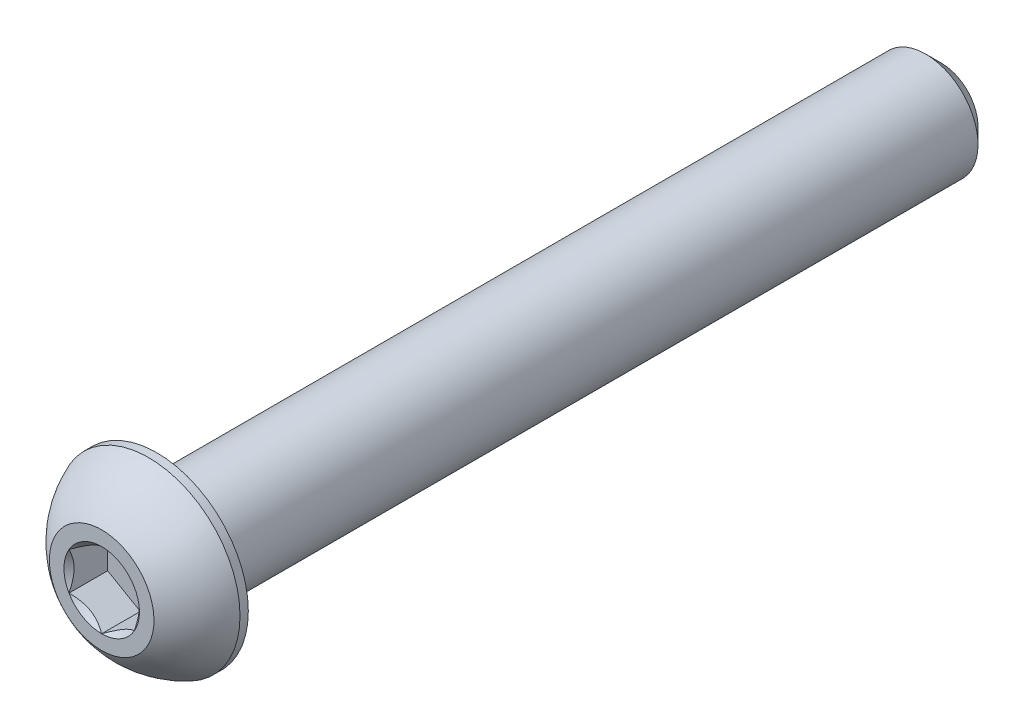
ISO-10303-21;
HEADER;
FILE_DESCRIPTION(('STEP AP214'),'2;1');
FILE_NAME('part.step','',(''),(''),'','','');
FILE_SCHEMA(('AUTOMOTIVE_DESIGN { 1 0 10303 214 1 1 1 1 }'));
ENDSEC;
DATA;
#1=APPLICATION_CONTEXT('core data for automotive mechanical design processes');
#2=APPLICATION_PROTOCOL_DEFINITION('international standard','automotive_design',2000,#1);
#3=PRODUCT_CONTEXT('',#1,'mechanical');
#4=PRODUCT('Part','Part','',(#3));
#5=PRODUCT_RELATED_PRODUCT_CATEGORY('part','',(#4));
#6=PRODUCT_DEFINITION_FORMATION('','',#4);
#7=PRODUCT_DEFINITION_CONTEXT('part definition',#1,'design');
#8=PRODUCT_DEFINITION('design','',#6,#7);
#9=PRODUCT_DEFINITION_SHAPE('','',#8);
#10=(LENGTH_UNIT() NAMED_UNIT(*) SI_UNIT(.MILLI.,.METRE.));
#11=(NAMED_UNIT(*) PLANE_ANGLE_UNIT() SI_UNIT($,.RADIAN.));
#12=(NAMED_UNIT(*) SI_UNIT($,.STERADIAN.) SOLID_ANGLE_UNIT());
#13=UNCERTAINTY_MEASURE_WITH_UNIT(LENGTH_MEASURE(1.E-05),#10,'distance_accuracy_value','');
#14=(GEOMETRIC_REPRESENTATION_CONTEXT(3) GLOBAL_UNCERTAINTY_ASSIGNED_CONTEXT((#13)) GLOBAL_UNIT_ASSIGNED_CONTEXT((#10,
#11,#12)) REPRESENTATION_CONTEXT('',''));
#15=CARTESIAN_POINT('',(0.,0.,0.));
#16=DIRECTION('',(0.,0.,1.));
#17=DIRECTION('',(1.,0.,0.));
#18=AXIS2_PLACEMENT_3D('',#15,#16,#17);
#19=CARTESIAN_POINT('',(0.,-3.175,-50.9778));
#20=DIRECTION('',(0.,0.,-1.));
#21=DIRECTION('',(0.,1.,0.));
#22=AXIS2_PLACEMENT_3D('',#19,#20,#21);
#23=PLANE('',#22);
#24=CARTESIAN_POINT('',(0.,0.,-50.9778));
#25=DIRECTION('',(0.,0.,-1.));
#26=DIRECTION('',(0.,1.,0.));
#27=AXIS2_PLACEMENT_3D('',#24,#25,#26);
#28=CIRCLE('',#27,2.2225);
#29=CARTESIAN_POINT('',(0.,2.2225,-50.9778));
#30=VERTEX_POINT('',#29);
#31=EDGE_CURVE('E173',#30,#30,#28,.T.);
#32=ORIENTED_EDGE('',*,*,#31,.T.);
#33=EDGE_LOOP('',(#32));
#34=FACE_BOUND('',#33,.T.);
#35=ADVANCED_FACE('F34',(#34),#23,.T.);
#36=CARTESIAN_POINT('',(0.,0.,-50.9778));
#37=DIRECTION('',(0.,0.,-1.));
#38=DIRECTION('',(0.,1.,0.));
#39=AXIS2_PLACEMENT_3D('',#36,#37,#38);
#40=CYLINDRICAL_SURFACE('',#39,3.175);
#41=CARTESIAN_POINT('',(0.,0.,-50.0253));
#42=DIRECTION('',(0.,0.,-1.));
#43=DIRECTION('',(0.,1.,0.));
#44=AXIS2_PLACEMENT_3D('',#41,#42,#43);
#45=CIRCLE('',#44,3.175);
#46=CARTESIAN_POINT('',(0.,3.175,-50.0253));
#47=VERTEX_POINT('',#46);
#48=EDGE_CURVE('E47',#47,#47,#45,.F.);
#49=ORIENTED_EDGE('',*,*,#48,.T.);
#50=EDGE_LOOP('',(#49));
#51=FACE_BOUND('',#50,.T.);
#52=CARTESIAN_POINT('',(0.,0.,-3.3528));
#53=DIRECTION('',(0.,0.,1.));
#54=DIRECTION('',(1.,0.,0.));
#55=AXIS2_PLACEMENT_3D('',#52,#53,#54);
#56=CIRCLE('',#55,3.175);
#57=CARTESIAN_POINT('',(3.175,0.,-3.3528));
#58=VERTEX_POINT('',#57);
#59=EDGE_CURVE('E170',#58,#58,#56,.F.);
#60=ORIENTED_EDGE('',*,*,#59,.T.);
#61=EDGE_LOOP('',(#60));
#62=FACE_BOUND('',#61,.T.);
#63=ADVANCED_FACE('F178',(#51,#62),#40,.T.);
#64=CARTESIAN_POINT('',(0.,0.,-50.9778));
#65=DIRECTION('',(0.,0.,1.));
#66=DIRECTION('',(0.,-1.,0.));
#67=AXIS2_PLACEMENT_3D('',#64,#65,#66);
#68=CONICAL_SURFACE('',#67,2.2225,0.785398163397447);
#69=ORIENTED_EDGE('',*,*,#48,.F.);
#70=EDGE_LOOP('',(#69));
#71=FACE_BOUND('',#70,.T.);
#72=ORIENTED_EDGE('',*,*,#31,.F.);
#73=EDGE_LOOP('',(#72));
#74=FACE_BOUND('',#73,.T.);
#75=ADVANCED_FACE('F36',(#71,#74),#68,.T.);
#76=CARTESIAN_POINT('',(0.,0.,-5.060315));
#77=DIRECTION('',(0.,0.,1.));
#78=DIRECTION('',(0.,-1.,0.));
#79=AXIS2_PLACEMENT_3D('',#76,#77,#78);
#80=SPHERICAL_SURFACE('',#79,5.97389428256184);
#81=CARTESIAN_POINT('',(0.,0.,0.));
#82=DIRECTION('',(0.,0.,1.));
#83=DIRECTION('',(1.,0.,0.));
#84=AXIS2_PLACEMENT_3D('',#81,#82,#83);
#85=CIRCLE('',#84,3.175);
#86=CARTESIAN_POINT('',(0.,-3.175,0.));
#87=VERTEX_POINT('',#86);
#88=EDGE_CURVE('E167',#87,#87,#85,.T.);
#89=CARTESIAN_POINT('',(0.,0.,-2.84988));
#90=DIRECTION('',(0.,0.,1.));
#91=DIRECTION('',(1.,0.,0.));
#92=AXIS2_PLACEMENT_3D('',#89,#90,#91);
#93=CIRCLE('',#92,5.5499);
#94=CARTESIAN_POINT('',(0.,-5.5499,-2.84988));
#95=VERTEX_POINT('',#94);
#96=EDGE_CURVE('E161',#95,#95,#93,.T.);
#97=CARTESIAN_POINT('',(0.,-3.175,0.));
#98=CARTESIAN_POINT('',(0.,-3.20828343957184,-0.0208830076580488));
#99=CARTESIAN_POINT('',(0.,-3.24136078860705,-0.0420944789280492));
#100=CARTESIAN_POINT('',(0.,-3.3070905577514,-0.0851658910984713));
#101=CARTESIAN_POINT('',(0.,-3.33974297786056,-0.107025831998893));
#102=CARTESIAN_POINT('',(0.,-3.40461014130008,-0.151385725836676));
#103=CARTESIAN_POINT('',(0.,-3.43682488463043,-0.173885678774038));
#104=CARTESIAN_POINT('',(0.,-3.50080416139461,-0.219516822259478));
#105=CARTESIAN_POINT('',(0.,-3.53256869482844,-0.242648012807557));
#106=CARTESIAN_POINT('',(0.,-3.59563518208834,-0.289532629449102));
#107=CARTESIAN_POINT('',(0.,-3.62693713591442,-0.313286055542568));
#108=CARTESIAN_POINT('',(0.,-3.68906627753106,-0.361405894091329));
#109=CARTESIAN_POINT('',(0.,-3.71989346532163,-0.385772306546625));
#110=CARTESIAN_POINT('',(0.,-3.78106107243204,-0.435108631276876));
#111=CARTESIAN_POINT('',(0.,-3.81140149175189,-0.460078543551832));
#112=CARTESIAN_POINT('',(0.,-3.87158374923259,-0.510612146063937));
#113=CARTESIAN_POINT('',(0.,-3.90142558739343,-0.536175836301086));
#114=CARTESIAN_POINT('',(0.,-3.96059906392414,-0.587887041792083));
#115=CARTESIAN_POINT('',(0.,-3.989930702294,-0.614034557045931));
#116=CARTESIAN_POINT('',(0.,-4.04807235926832,-0.666903232293406));
#117=CARTESIAN_POINT('',(0.,-4.07688237787279,-0.693624392287033));
#118=CARTESIAN_POINT('',(0.,-4.13396957842491,-0.747629953401057));
#119=CARTESIAN_POINT('',(0.,-4.16224676037256,-0.774914354521453));
#120=CARTESIAN_POINT('',(0.,-4.21825727817542,-0.830035774981947));
#121=CARTESIAN_POINT('',(0.,-4.24599061403061,-0.857872794322044));
#122=CARTESIAN_POINT('',(0.,-4.30090264195357,-0.91408861315902));
#123=CARTESIAN_POINT('',(0.,-4.32808133402134,-0.942467412655899));
#124=CARTESIAN_POINT('',(0.,-4.38187349261952,-0.999755742806741));
#125=CARTESIAN_POINT('',(0.,-4.40848695914995,-1.0286652734607));
#126=CARTESIAN_POINT('',(0.,-4.46113830498838,-1.08700381029123));
#127=CARTESIAN_POINT('',(0.,-4.48717618429639,-1.11643281646778));
#128=CARTESIAN_POINT('',(0.,-4.53866621810402,-1.17579884645643));
#129=CARTESIAN_POINT('',(0.,-4.56411837260364,-1.20573587026853));
#130=CARTESIAN_POINT('',(0.,-4.61442704725457,-1.26610627984964));
#131=CARTESIAN_POINT('',(0.,-4.63928356740587,-1.29653966561866));
#132=CARTESIAN_POINT('',(0.,-4.68839129572448,-1.3578909501815));
#133=CARTESIAN_POINT('',(0.,-4.71264250389178,-1.38880884897531));
#134=CARTESIAN_POINT('',(0.,-4.76053016627881,-1.45111712201534));
#135=CARTESIAN_POINT('',(0.,-4.78416662049853,-1.48250749626155));
#136=CARTESIAN_POINT('',(0.,-4.8308155723751,-1.54574849868041));
#137=CARTESIAN_POINT('',(0.,-4.85382807003194,-1.57759912685306));
#138=CARTESIAN_POINT('',(0.,-4.89922014909859,-1.64174823640362));
#139=CARTESIAN_POINT('',(0.,-4.92159973050841,-1.67404671778154));
#140=CARTESIAN_POINT('',(0.,-4.96571726381658,-1.73907895865427));
#141=CARTESIAN_POINT('',(0.,-4.98745521571493,-1.77181271814908));
#142=CARTESIAN_POINT('',(0.,-5.03028102654719,-1.83770277069632));
#143=CARTESIAN_POINT('',(0.,-5.0513688854811,-1.87085906374874));
#144=CARTESIAN_POINT('',(0.,-5.09288630004063,-1.93758127434189));
#145=CARTESIAN_POINT('',(0.,-5.11331585566624,-1.97114719188261));
#146=CARTESIAN_POINT('',(0.,-5.15350870956168,-2.03867558290299));
#147=CARTESIAN_POINT('',(0.,-5.17327200783151,-2.07263805638265));
#148=CARTESIAN_POINT('',(0.,-5.21212465239608,-2.14094633632486));
#149=CARTESIAN_POINT('',(0.,-5.23121399869082,-2.17529214278741));
#150=CARTESIAN_POINT('',(0.,-5.26871130697935,-2.2443537165359));
#151=CARTESIAN_POINT('',(0.,-5.28711926897315,-2.27906948382184));
#152=CARTESIAN_POINT('',(0.,-5.32324664200827,-2.3488574628552));
#153=CARTESIAN_POINT('',(0.,-5.3409660530496,-2.38392967460262));
#154=CARTESIAN_POINT('',(0.,-5.37570942417474,-2.45441688802313));
#155=CARTESIAN_POINT('',(0.,-5.39273338425856,-2.48983188969622));
#156=CARTESIAN_POINT('',(0.,-5.42607922958184,-2.56099089271574));
#157=CARTESIAN_POINT('',(0.,-5.44240111482132,-2.59673489406217));
#158=CARTESIAN_POINT('',(0.,-5.47433643994316,-2.66853798649801));
#159=CARTESIAN_POINT('',(0.,-5.48994987982553,-2.70459707758742));
#160=CARTESIAN_POINT('',(0.,-5.52046229408188,-2.77701628549785));
#161=CARTESIAN_POINT('',(0.,-5.53536126845586,-2.81337640231887));
#162=CARTESIAN_POINT('',(0.,-5.5499,-2.84988));
#163=B_SPLINE_CURVE_WITH_KNOTS('',3,(#97,#98,#99,#100,#101,#102,#103,#104,#105,#106,#107,#108,
#109,#110,#111,#112,#113,#114,#115,#116,#117,#118,#119,#120,#121,#122,#123,#124,#125,#126,#127,
#128,#129,#130,#131,#132,#133,#134,#135,#136,#137,#138,#139,#140,#141,#142,#143,#144,#145,#146,
#147,#148,#149,#150,#151,#152,#153,#154,#155,#156,#157,#158,#159,#160,#161,#162),.UNSPECIFIED.,
.F.,.F.,(4,2,2,2,2,2,2,2,2,2,2,2,2,2,2,2,2,2,2,2,2,2,2,2,2,2,2,2,2,2,2,2,4),(0.,0.1178750807537,
0.2357501615074,0.353625242261099,0.471500323014799,0.589375403768499,0.707250484522198,
0.825125565275897,0.943000646029598,1.0608757267833,1.178750807537,1.2966258882907,
1.41450096904439,1.53237604979809,1.65025113055179,1.76812621130549,1.88600129205919,
2.00387637281289,2.12175145356659,2.23962653432029,2.35750161507399,2.47537669582769,
2.59325177658139,2.71112685733509,2.82900193808879,2.94687701884249,3.06475209959619,
3.18262718034989,3.30050226110359,3.41837734185729,3.53625242261099,3.65412750336469,
3.77200258411839),.UNSPECIFIED.);
#164=EDGE_CURVE('BSEAM183',#87,#95,#163,.T.);
#165=ORIENTED_EDGE('',*,*,#88,.F.);
#166=ORIENTED_EDGE('',*,*,#96,.T.);
#167=ORIENTED_EDGE('',*,*,#164,.T.);
#168=ORIENTED_EDGE('',*,*,#164,.F.);
#169=EDGE_LOOP('',(#165,#167,#166,#168));
#170=FACE_BOUND('',#169,.T.);
#171=ADVANCED_FACE('F183',(#170),#80,.T.);
#172=CARTESIAN_POINT('',(0.,-3.175,0.));
#173=DIRECTION('',(0.,0.,-1.));
#174=DIRECTION('',(-1.,0.,0.));
#175=AXIS2_PLACEMENT_3D('',#172,#173,#174);
#176=PLANE('',#175);
#177=CARTESIAN_POINT('',(0.,0.,0.));
#178=DIRECTION('',(0.,0.,1.));
#179=DIRECTION('',(1.,0.,0.));
#180=AXIS2_PLACEMENT_3D('',#177,#178,#179);
#181=CIRCLE('',#180,2.29135888084633);
#182=CARTESIAN_POINT('',(-1.984375,1.14567944042316,0.));
#183=VERTEX_POINT('',#182);
#184=CARTESIAN_POINT('',(-1.984375,-1.14567944042316,0.));
#185=VERTEX_POINT('',#184);
#186=EDGE_CURVE('E60',#183,#185,#181,.T.);
#187=ORIENTED_EDGE('',*,*,#186,.F.);
#188=CARTESIAN_POINT('',(0.,2.29135888084633,0.));
#189=VERTEX_POINT('',#188);
#190=EDGE_CURVE('E132',#189,#183,#181,.T.);
#191=ORIENTED_EDGE('',*,*,#190,.F.);
#192=CARTESIAN_POINT('',(1.984375,1.14567944042316,0.));
#193=VERTEX_POINT('',#192);
#194=EDGE_CURVE('E129',#193,#189,#181,.T.);
#195=ORIENTED_EDGE('',*,*,#194,.F.);
#196=CARTESIAN_POINT('',(1.984375,-1.14567944042316,0.));
#197=VERTEX_POINT('',#196);
#198=EDGE_CURVE('E100',#197,#193,#181,.T.);
#199=ORIENTED_EDGE('',*,*,#198,.F.);
#200=CARTESIAN_POINT('',(0.,-2.29135888084633,0.));
#201=VERTEX_POINT('',#200);
#202=EDGE_CURVE('E92',#201,#197,#181,.T.);
#203=ORIENTED_EDGE('',*,*,#202,.F.);
#204=EDGE_CURVE('E53',#185,#201,#181,.T.);
#205=ORIENTED_EDGE('',*,*,#204,.F.);
#206=EDGE_LOOP('',(#187,#191,#195,#199,#203,#205));
#207=FACE_BOUND('',#206,.T.);
#208=ORIENTED_EDGE('',*,*,#88,.T.);
#209=EDGE_LOOP('',(#208));
#210=FACE_BOUND('',#209,.T.);
#211=ADVANCED_FACE('F126',(#207,#210),#176,.F.);
#212=CARTESIAN_POINT('',(0.,-5.5499,-3.3528));
#213=DIRECTION('',(0.,0.,1.));
#214=DIRECTION('',(1.,0.,0.));
#215=AXIS2_PLACEMENT_3D('',#212,#213,#214);
#216=PLANE('',#215);
#217=ORIENTED_EDGE('',*,*,#59,.F.);
#218=EDGE_LOOP('',(#217));
#219=FACE_BOUND('',#218,.T.);
#220=CARTESIAN_POINT('',(0.,0.,-3.3528));
#221=DIRECTION('',(0.,0.,1.));
#222=DIRECTION('',(1.,0.,0.));
#223=AXIS2_PLACEMENT_3D('',#220,#221,#222);
#224=CIRCLE('',#223,5.5499);
#225=CARTESIAN_POINT('',(5.5499,0.,-3.3528));
#226=VERTEX_POINT('',#225);
#227=EDGE_CURVE('E164',#226,#226,#224,.T.);
#228=ORIENTED_EDGE('',*,*,#227,.F.);
#229=EDGE_LOOP('',(#228));
#230=FACE_BOUND('',#229,.T.);
#231=ADVANCED_FACE('F197',(#219,#230),#216,.F.);
#232=CARTESIAN_POINT('',(0.,0.,0.));
#233=DIRECTION('',(0.,0.,1.));
#234=DIRECTION('',(1.,0.,0.));
#235=AXIS2_PLACEMENT_3D('',#232,#233,#234);
#236=CYLINDRICAL_SURFACE('',#235,5.5499);
#237=ORIENTED_EDGE('',*,*,#96,.F.);
#238=EDGE_LOOP('',(#237));
#239=FACE_BOUND('',#238,.T.);
#240=ORIENTED_EDGE('',*,*,#227,.T.);
#241=EDGE_LOOP('',(#240));
#242=FACE_BOUND('',#241,.T.);
#243=ADVANCED_FACE('F200',(#239,#242),#236,.T.);
#244=CARTESIAN_POINT('',(0.,0.,0.));
#245=DIRECTION('',(0.,0.,1.));
#246=DIRECTION('',(1.,0.,0.));
#247=AXIS2_PLACEMENT_3D('',#244,#245,#246);
#248=CONICAL_SURFACE('',#247,2.29135888084633,0.78539816339745);
#249=ORIENTED_EDGE('',*,*,#198,.T.);
#250=CARTESIAN_POINT('',(1.984375,-2.28495242157822,0.734984078816568));
#251=CARTESIAN_POINT('',(1.984375,-2.22931635455402,0.692986685550761));
#252=CARTESIAN_POINT('',(1.984375,-2.17336876548389,0.651396054076336));
#253=CARTESIAN_POINT('',(1.984375,-2.06072770258171,0.569208461471479));
#254=CARTESIAN_POINT('',(1.984375,-2.00403404503435,0.528611752405042));
#255=CARTESIAN_POINT('',(1.984375,-1.88936329173488,0.448303503174669));
#256=CARTESIAN_POINT('',(1.984375,-1.83137965519348,0.408601258813307));
#257=CARTESIAN_POINT('',(1.984375,-1.7144280213784,0.330685173401292));
#258=CARTESIAN_POINT('',(1.984375,-1.65546009407228,0.292471227194368));
#259=CARTESIAN_POINT('',(1.984375,-1.47005472306035,0.176252834013636));
#260=CARTESIAN_POINT('',(1.984375,-1.34163909427883,0.101347886872381));
#261=CARTESIAN_POINT('',(1.984375,-1.0784038470548,-0.0356697845602626));
#262=CARTESIAN_POINT('',(1.984375,-0.943607781407425,-0.0978256335176257));
#263=CARTESIAN_POINT('',(1.984375,-0.741275100444882,-0.173867421311381));
#264=CARTESIAN_POINT('',(1.984375,-0.676735408881095,-0.195691938673995));
#265=CARTESIAN_POINT('',(1.984375,-0.546098118112762,-0.234159536462205));
#266=CARTESIAN_POINT('',(1.984375,-0.480000411919956,-0.250802259934452));
#267=CARTESIAN_POINT('',(1.984375,-0.347746170028532,-0.277764619130277));
#268=CARTESIAN_POINT('',(1.984375,-0.281612071479123,-0.288192590264108));
#269=CARTESIAN_POINT('',(1.984375,-0.14863662005235,-0.302521852623404));
#270=CARTESIAN_POINT('',(1.984375,-0.0817953907393235,-0.306424265772614));
#271=CARTESIAN_POINT('',(1.984375,0.0495156750890646,-0.307412948667328));
#272=CARTESIAN_POINT('',(1.984375,0.113983775102992,-0.304740821124985));
#273=CARTESIAN_POINT('',(1.984375,0.242367515846177,-0.293260789502485));
#274=CARTESIAN_POINT('',(1.984375,0.30628310229592,-0.284452289360786));
#275=CARTESIAN_POINT('',(1.984375,0.434181040262184,-0.261030978667103));
#276=CARTESIAN_POINT('',(1.984375,0.498145026858309,-0.246319393767914));
#277=CARTESIAN_POINT('',(1.984375,0.624675616953007,-0.211873818587874));
#278=CARTESIAN_POINT('',(1.984375,0.687242336899689,-0.192140248550805));
#279=CARTESIAN_POINT('',(1.984375,0.884225483826087,-0.12258776276924));
#280=CARTESIAN_POINT('',(1.984375,1.01583674256468,-0.0648475887435035));
#281=CARTESIAN_POINT('',(1.984375,1.27288659242652,0.0635303365887973));
#282=CARTESIAN_POINT('',(1.984375,1.3983008827048,0.134214424919412));
#283=CARTESIAN_POINT('',(1.984375,1.57956687990221,0.244516663813198));
#284=CARTESIAN_POINT('',(1.984375,1.63738271299424,0.280969829475363));
#285=CARTESIAN_POINT('',(1.984375,1.75202215386201,0.355415963291704));
#286=CARTESIAN_POINT('',(1.984375,1.80884568601361,0.393409048078053));
#287=CARTESIAN_POINT('',(1.984375,1.92116923084255,0.470338808893089));
#288=CARTESIAN_POINT('',(1.984375,1.97667624512253,0.50926531303879));
#289=CARTESIAN_POINT('',(1.984375,2.08693170717166,0.588147746121385));
#290=CARTESIAN_POINT('',(1.984375,2.14168035934792,0.628103389024029));
#291=CARTESIAN_POINT('',(1.984375,2.19611149046622,0.668480611285425));
#292=B_SPLINE_CURVE_WITH_KNOTS('',3,(#250,#251,#252,#253,#254,#255,#256,#257,#258,#259,#260,
#261,#262,#263,#264,#265,#266,#267,#268,#269,#270,#271,#272,#273,#274,#275,#276,#277,#278,#279,
#280,#281,#282,#283,#284,#285,#286,#287,#288,#289,#290,#291),.UNSPECIFIED.,.F.,.F.,(4,2,2,2,2,2,
2,2,2,2,2,2,2,2,2,2,2,2,2,2,4),(0.,0.209126070008322,0.418304637356569,0.629103979977992,
0.839888401371185,1.28549951116127,1.72957750768351,1.93379389749971,2.13802435186698,
2.33858179514334,2.53910475350639,2.73236963400794,2.92565329006887,3.12231577097487,
3.31896180041345,3.74886295245172,4.18033428125362,4.3853601718029,4.59040161996382,
4.79377749165107,4.99709743524131),.UNSPECIFIED.);
#293=EDGE_CURVE('E11',#197,#193,#292,.T.);
#294=ORIENTED_EDGE('',*,*,#293,.F.);
#295=EDGE_LOOP('',(#249,#294));
#296=FACE_BOUND('',#295,.T.);
#297=ADVANCED_FACE('F104',(#296),#248,.F.);
#298=ORIENTED_EDGE('',*,*,#194,.T.);
#299=CARTESIAN_POINT('',(1.984575,1.14556397036933,0.000115478781843379));
#300=CARTESIAN_POINT('',(1.9163590048332,1.18494849354192,-0.0392371477360852));
#301=CARTESIAN_POINT('',(1.84700231489303,1.22499159714897,-0.0762786895538154));
#302=CARTESIAN_POINT('',(1.70557619954781,1.30664400291398,-0.144101141576677));
#303=CARTESIAN_POINT('',(1.63349332126322,1.34826107209555,-0.174844310908246));
#304=CARTESIAN_POINT('',(1.488141602734,1.43217992591557,-0.227508111188786));
#305=CARTESIAN_POINT('',(1.41490978751306,1.47446033414663,-0.249561124120036));
#306=CARTESIAN_POINT('',(1.26683381740529,1.55995203534886,-0.283538507056124));
#307=CARTESIAN_POINT('',(1.19199418724658,1.60316071596705,-0.295488243908272));
#308=CARTESIAN_POINT('',(1.06301458545618,1.6776271237807,-0.306269900918094));
#309=CARTESIAN_POINT('',(1.00904128422756,1.7087886237741,-0.30786610094093));
#310=CARTESIAN_POINT('',(0.901182881480199,1.77106070163465,-0.305178161134708));
#311=CARTESIAN_POINT('',(0.847297817514476,1.80217125782056,-0.300891959659541));
#312=CARTESIAN_POINT('',(0.740036461751395,1.86409863044402,-0.286683126986481));
#313=CARTESIAN_POINT('',(0.686660807239859,1.89491507894443,-0.276754189547727));
#314=CARTESIAN_POINT('',(0.580832482591103,1.95601509066828,-0.251804915725461));
#315=CARTESIAN_POINT('',(0.528379742028898,1.9862986945516,-0.236784969610512));
#316=CARTESIAN_POINT('',(0.394017661036351,2.06387267818152,-0.19219214836433));
#317=CARTESIAN_POINT('',(0.312941642841675,2.11068193911104,-0.159257004061668));
#318=CARTESIAN_POINT('',(0.19372669327016,2.17951072233758,-0.103657558797803));
#319=CARTESIAN_POINT('',(0.154440075613998,2.20219286161692,-0.0841224079481377));
#320=CARTESIAN_POINT('',(0.0765946381319466,2.24713694590237,-0.0432712618805983));
#321=CARTESIAN_POINT('',(0.0380353888983007,2.26939913882716,-0.0219563604316494));
#322=CARTESIAN_POINT('',(-0.000200000000000694,2.29147435090017,0.000115478781842942));
#323=B_SPLINE_CURVE_WITH_KNOTS('',3,(#299,#300,#301,#302,#303,#304,#305,#306,#307,#308,#309,
#310,#311,#312,#313,#314,#315,#316,#317,#318,#319,#320,#321,#322),.UNSPECIFIED.,.F.,.F.,(4,2,2,
2,2,2,2,2,2,2,2,4),(0.,0.264339630306627,0.530219665093694,0.791876416371461,1.05287424418109,
1.239639843932,1.42647091743852,1.61351120244035,1.8005371524754,2.09764209964316,
2.24579179873714,2.39385111134157),.UNSPECIFIED.);
#324=EDGE_CURVE('E131',#193,#189,#323,.T.);
#325=ORIENTED_EDGE('',*,*,#324,.F.);
#326=EDGE_LOOP('',(#298,#325));
#327=FACE_BOUND('',#326,.T.);
#328=ADVANCED_FACE('F280',(#327),#248,.F.);
#329=ORIENTED_EDGE('',*,*,#190,.T.);
#330=CARTESIAN_POINT('',(0.000199999999999584,2.29147435090017,0.000115478781843248));
#331=CARTESIAN_POINT('',(-0.0680159951668027,2.25208982772757,-0.0392371477360854));
#332=CARTESIAN_POINT('',(-0.137372685106966,2.21204672412052,-0.0762786895538155));
#333=CARTESIAN_POINT('',(-0.278798800452188,2.13039431835551,-0.144101141576677));
#334=CARTESIAN_POINT('',(-0.350881678736783,2.08877724917394,-0.174844310908246));
#335=CARTESIAN_POINT('',(-0.496233397266004,2.00485839535392,-0.227508111188786));
#336=CARTESIAN_POINT('',(-0.569465212486939,1.96257798712287,-0.249561124120036));
#337=CARTESIAN_POINT('',(-0.717541182594707,1.87708628592063,-0.283538507056124));
#338=CARTESIAN_POINT('',(-0.792380812753425,1.83387760530244,-0.295488243908272));
#339=CARTESIAN_POINT('',(-0.921360414543816,1.75941119748879,-0.306269900918094));
#340=CARTESIAN_POINT('',(-0.975333715772443,1.72824969749539,-0.307866100940931));
#341=CARTESIAN_POINT('',(-1.0831921185198,1.66597761963484,-0.305178161134708));
#342=CARTESIAN_POINT('',(-1.13707718248552,1.63486706344893,-0.300891959659541));
#343=CARTESIAN_POINT('',(-1.2443385382486,1.57293969082547,-0.286683126986481));
#344=CARTESIAN_POINT('',(-1.29771419276014,1.54212324232506,-0.276754189547727));
#345=CARTESIAN_POINT('',(-1.4035425174089,1.48102323060122,-0.251804915725462));
#346=CARTESIAN_POINT('',(-1.4559952579711,1.45073962671789,-0.236784969610512));
#347=CARTESIAN_POINT('',(-1.59035733896365,1.37316564308797,-0.19219214836433));
#348=CARTESIAN_POINT('',(-1.67143335715832,1.32635638215845,-0.159257004061668));
#349=CARTESIAN_POINT('',(-1.79064830672984,1.25752759893191,-0.103657558797804));
#350=CARTESIAN_POINT('',(-1.829934924386,1.23484545965257,-0.0841224079481378));
#351=CARTESIAN_POINT('',(-1.90778036186805,1.18990137536712,-0.0432712618805986));
#352=CARTESIAN_POINT('',(-1.9463396111017,1.16763918244233,-0.0219563604316498));
#353=CARTESIAN_POINT('',(-1.984575,1.14556397036933,0.000115478781842511));
#354=B_SPLINE_CURVE_WITH_KNOTS('',3,(#330,#331,#332,#333,#334,#335,#336,#337,#338,#339,#340,
#341,#342,#343,#344,#345,#346,#347,#348,#349,#350,#351,#352,#353),.UNSPECIFIED.,.F.,.F.,(4,2,2,
2,2,2,2,2,2,2,2,4),(0.,0.264339630306627,0.530219665093694,0.791876416371461,1.05287424418109,
1.239639843932,1.42647091743852,1.61351120244035,1.8005371524754,2.09764209964316,
2.24579179873714,2.39385111134157),.UNSPECIFIED.);
#355=EDGE_CURVE('E136',#189,#183,#354,.T.);
#356=ORIENTED_EDGE('',*,*,#355,.F.);
#357=EDGE_LOOP('',(#329,#356));
#358=FACE_BOUND('',#357,.T.);
#359=ADVANCED_FACE('F139',(#358),#248,.F.);
#360=ORIENTED_EDGE('',*,*,#186,.T.);
#361=CARTESIAN_POINT('',(-1.984375,-2.28495242157822,0.734984078816568));
#362=CARTESIAN_POINT('',(-1.984375,-2.22931635455402,0.692986685550762));
#363=CARTESIAN_POINT('',(-1.984375,-2.17336876548389,0.651396054076336));
#364=CARTESIAN_POINT('',(-1.984375,-2.06072770258171,0.569208461471479));
#365=CARTESIAN_POINT('',(-1.984375,-2.00403404503435,0.528611752405043));
#366=CARTESIAN_POINT('',(-1.984375,-1.88936329173489,0.448303503174669));
#367=CARTESIAN_POINT('',(-1.984375,-1.83137965519348,0.408601258813307));
#368=CARTESIAN_POINT('',(-1.984375,-1.7144280213784,0.330685173401292));
#369=CARTESIAN_POINT('',(-1.984375,-1.65546009407228,0.292471227194368));
#370=CARTESIAN_POINT('',(-1.984375,-1.47005472306035,0.176252834013636));
#371=CARTESIAN_POINT('',(-1.984375,-1.34163909427883,0.101347886872381));
#372=CARTESIAN_POINT('',(-1.984375,-1.0784038470548,-0.0356697845602625));
#373=CARTESIAN_POINT('',(-1.984375,-0.943607781407425,-0.0978256335176254));
#374=CARTESIAN_POINT('',(-1.984375,-0.741275100444882,-0.173867421311381));
#375=CARTESIAN_POINT('',(-1.984375,-0.676735408881095,-0.195691938673995));
#376=CARTESIAN_POINT('',(-1.984375,-0.546098118112762,-0.234159536462205));
#377=CARTESIAN_POINT('',(-1.984375,-0.480000411919956,-0.250802259934452));
#378=CARTESIAN_POINT('',(-1.984375,-0.347746170028532,-0.277764619130277));
#379=CARTESIAN_POINT('',(-1.984375,-0.281612071479123,-0.288192590264108));
#380=CARTESIAN_POINT('',(-1.984375,-0.14863662005235,-0.302521852623404));
#381=CARTESIAN_POINT('',(-1.984375,-0.0817953907393238,-0.306424265772614));
#382=CARTESIAN_POINT('',(-1.984375,0.0495156750890643,-0.307412948667328));
#383=CARTESIAN_POINT('',(-1.984375,0.113983775102991,-0.304740821124985));
#384=CARTESIAN_POINT('',(-1.984375,0.242367515846177,-0.293260789502485));
#385=CARTESIAN_POINT('',(-1.984375,0.306283102295919,-0.284452289360786));
#386=CARTESIAN_POINT('',(-1.984375,0.434181040262184,-0.261030978667103));
#387=CARTESIAN_POINT('',(-1.984375,0.498145026858309,-0.246319393767914));
#388=CARTESIAN_POINT('',(-1.984375,0.624675616953007,-0.211873818587874));
#389=CARTESIAN_POINT('',(-1.984375,0.687242336899689,-0.192140248550805));
#390=CARTESIAN_POINT('',(-1.984375,0.884225483826087,-0.12258776276924));
#391=CARTESIAN_POINT('',(-1.984375,1.01583674256468,-0.0648475887435032));
#392=CARTESIAN_POINT('',(-1.984375,1.27288659242652,0.0635303365887978));
#393=CARTESIAN_POINT('',(-1.984375,1.3983008827048,0.134214424919412));
#394=CARTESIAN_POINT('',(-1.984375,1.57956687990221,0.244516663813198));
#395=CARTESIAN_POINT('',(-1.984375,1.63738271299424,0.280969829475363));
#396=CARTESIAN_POINT('',(-1.984375,1.75202215386202,0.355415963291704));
#397=CARTESIAN_POINT('',(-1.984375,1.80884568601362,0.393409048078053));
#398=CARTESIAN_POINT('',(-1.984375,1.92116923084255,0.47033880889309));
#399=CARTESIAN_POINT('',(-1.984375,1.97667624512253,0.509265313038791));
#400=CARTESIAN_POINT('',(-1.984375,2.08693170717166,0.588147746121386));
#401=CARTESIAN_POINT('',(-1.984375,2.14168035934793,0.628103389024029));
#402=CARTESIAN_POINT('',(-1.984375,2.19611149046622,0.668480611285426));
#403=B_SPLINE_CURVE_WITH_KNOTS('',3,(#361,#362,#363,#364,#365,#366,#367,#368,#369,#370,#371,
#372,#373,#374,#375,#376,#377,#378,#379,#380,#381,#382,#383,#384,#385,#386,#387,#388,#389,#390,
#391,#392,#393,#394,#395,#396,#397,#398,#399,#400,#401,#402),.UNSPECIFIED.,.F.,.F.,(4,2,2,2,2,2,
2,2,2,2,2,2,2,2,2,2,2,2,2,2,4),(0.,0.209126070008322,0.41830463735657,0.629103979977993,
0.839888401371186,1.28549951116127,1.72957750768351,1.93379389749972,2.13802435186698,
2.33858179514334,2.53910475350639,2.73236963400794,2.92565329006887,3.12231577097487,
3.31896180041345,3.74886295245172,4.18033428125362,4.3853601718029,4.59040161996383,
4.79377749165108,4.99709743524131),.UNSPECIFIED.);
#404=EDGE_CURVE('E143',#183,#185,#403,.F.);
#405=ORIENTED_EDGE('',*,*,#404,.F.);
#406=EDGE_LOOP('',(#360,#405));
#407=FACE_BOUND('',#406,.T.);
#408=ADVANCED_FACE('F274',(#407),#248,.F.);
#409=ORIENTED_EDGE('',*,*,#204,.T.);
#410=CARTESIAN_POINT('',(-1.984575,-1.14556397036933,0.000115478781842946));
#411=CARTESIAN_POINT('',(-1.9163590048332,-1.18494849354192,-0.0392371477360854));
#412=CARTESIAN_POINT('',(-1.84700231489303,-1.22499159714897,-0.0762786895538155));
#413=CARTESIAN_POINT('',(-1.70557619954781,-1.30664400291398,-0.144101141576677));
#414=CARTESIAN_POINT('',(-1.63349332126322,-1.34826107209555,-0.174844310908246));
#415=CARTESIAN_POINT('',(-1.488141602734,-1.43217992591557,-0.227508111188786));
#416=CARTESIAN_POINT('',(-1.41490978751306,-1.47446033414662,-0.249561124120036));
#417=CARTESIAN_POINT('',(-1.26683381740529,-1.55995203534886,-0.283538507056125));
#418=CARTESIAN_POINT('',(-1.19199418724658,-1.60316071596705,-0.295488243908272));
#419=CARTESIAN_POINT('',(-1.06301458545618,-1.6776271237807,-0.306269900918095));
#420=CARTESIAN_POINT('',(-1.00904128422756,-1.7087886237741,-0.307866100940931));
#421=CARTESIAN_POINT('',(-0.9011828814802,-1.77106070163465,-0.305178161134708));
#422=CARTESIAN_POINT('',(-0.847297817514477,-1.80217125782056,-0.300891959659541));
#423=CARTESIAN_POINT('',(-0.740036461751396,-1.86409863044402,-0.286683126986481));
#424=CARTESIAN_POINT('',(-0.68666080723986,-1.89491507894443,-0.276754189547728));
#425=CARTESIAN_POINT('',(-0.580832482591103,-1.95601509066827,-0.251804915725462));
#426=CARTESIAN_POINT('',(-0.528379742028898,-1.9862986945516,-0.236784969610513));
#427=CARTESIAN_POINT('',(-0.394017661036351,-2.06387267818152,-0.192192148364331));
#428=CARTESIAN_POINT('',(-0.312941642841675,-2.11068193911104,-0.159257004061668));
#429=CARTESIAN_POINT('',(-0.19372669327016,-2.17951072233758,-0.103657558797804));
#430=CARTESIAN_POINT('',(-0.154440075613998,-2.20219286161692,-0.0841224079481377));
#431=CARTESIAN_POINT('',(-0.0765946381319458,-2.24713694590237,-0.0432712618805983));
#432=CARTESIAN_POINT('',(-0.0380353888982999,-2.26939913882716,-0.0219563604316494));
#433=CARTESIAN_POINT('',(0.000200000000001552,-2.29147435090017,0.000115478781842944));
#434=B_SPLINE_CURVE_WITH_KNOTS('',3,(#410,#411,#412,#413,#414,#415,#416,#417,#418,#419,#420,
#421,#422,#423,#424,#425,#426,#427,#428,#429,#430,#431,#432,#433),.UNSPECIFIED.,.F.,.F.,(4,2,2,
2,2,2,2,2,2,2,2,4),(0.,0.264339630306627,0.530219665093694,0.79187641637146,1.05287424418109,
1.239639843932,1.42647091743852,1.61351120244035,1.8005371524754,2.09764209964316,
2.24579179873714,2.39385111134157),.UNSPECIFIED.);
#435=EDGE_CURVE('E116',#185,#201,#434,.T.);
#436=ORIENTED_EDGE('',*,*,#435,.F.);
#437=EDGE_LOOP('',(#409,#436));
#438=FACE_BOUND('',#437,.T.);
#439=ADVANCED_FACE('F225',(#438),#248,.F.);
#440=ORIENTED_EDGE('',*,*,#202,.T.);
#441=CARTESIAN_POINT('',(-0.000199999999998723,-2.29147435090017,0.000115478781843248));
#442=CARTESIAN_POINT('',(0.0680159951668037,-2.25208982772757,-0.0392371477360849));
#443=CARTESIAN_POINT('',(0.137372685106967,-2.21204672412052,-0.076278689553815));
#444=CARTESIAN_POINT('',(0.278798800452189,-2.13039431835551,-0.144101141576677));
#445=CARTESIAN_POINT('',(0.350881678736784,-2.08877724917394,-0.174844310908246));
#446=CARTESIAN_POINT('',(0.496233397266005,-2.00485839535392,-0.227508111188786));
#447=CARTESIAN_POINT('',(0.56946521248694,-1.96257798712287,-0.249561124120036));
#448=CARTESIAN_POINT('',(0.717541182594708,-1.87708628592063,-0.283538507056124));
#449=CARTESIAN_POINT('',(0.792380812753426,-1.83387760530244,-0.295488243908271));
#450=CARTESIAN_POINT('',(0.921360414543817,-1.75941119748879,-0.306269900918094));
#451=CARTESIAN_POINT('',(0.975333715772444,-1.72824969749539,-0.30786610094093));
#452=CARTESIAN_POINT('',(1.0831921185198,-1.66597761963484,-0.305178161134707));
#453=CARTESIAN_POINT('',(1.13707718248553,-1.63486706344893,-0.30089195965954));
#454=CARTESIAN_POINT('',(1.24433853824861,-1.57293969082547,-0.286683126986481));
#455=CARTESIAN_POINT('',(1.29771419276014,-1.54212324232506,-0.276754189547727));
#456=CARTESIAN_POINT('',(1.4035425174089,-1.48102323060122,-0.251804915725461));
#457=CARTESIAN_POINT('',(1.4559952579711,-1.45073962671789,-0.236784969610511));
#458=CARTESIAN_POINT('',(1.59035733896365,-1.37316564308797,-0.192192148364329));
#459=CARTESIAN_POINT('',(1.67143335715833,-1.32635638215845,-0.159257004061667));
#460=CARTESIAN_POINT('',(1.79064830672984,-1.25752759893191,-0.103657558797803));
#461=CARTESIAN_POINT('',(1.829934924386,-1.23484545965257,-0.0841224079481373));
#462=CARTESIAN_POINT('',(1.90778036186805,-1.18990137536712,-0.0432712618805982));
#463=CARTESIAN_POINT('',(1.9463396111017,-1.16763918244233,-0.0219563604316493));
#464=CARTESIAN_POINT('',(1.984575,-1.14556397036933,0.000115478781843057));
#465=B_SPLINE_CURVE_WITH_KNOTS('',3,(#441,#442,#443,#444,#445,#446,#447,#448,#449,#450,#451,
#452,#453,#454,#455,#456,#457,#458,#459,#460,#461,#462,#463,#464),.UNSPECIFIED.,.F.,.F.,(4,2,2,
2,2,2,2,2,2,2,2,4),(0.,0.264339630306627,0.530219665093694,0.791876416371461,1.05287424418109,
1.239639843932,1.42647091743852,1.61351120244035,1.8005371524754,2.09764209964316,
2.24579179873714,2.39385111134157),.UNSPECIFIED.);
#466=EDGE_CURVE('E96',#201,#197,#465,.T.);
#467=ORIENTED_EDGE('',*,*,#466,.F.);
#468=EDGE_LOOP('',(#440,#467));
#469=FACE_BOUND('',#468,.T.);
#470=ADVANCED_FACE('F94',(#469),#248,.F.);
#471=CARTESIAN_POINT('',(1.984375,-1.14567944042316,-2.34696));
#472=DIRECTION('',(0.,0.,1.));
#473=DIRECTION('',(1.,0.,0.));
#474=AXIS2_PLACEMENT_3D('',#471,#472,#473);
#475=PLANE('',#474);
#476=DIRECTION('',(0.866025403784438,0.5,0.));
#477=VECTOR('',#476,1.);
#478=CARTESIAN_POINT('',(0.,-2.29135888084633,-2.34696));
#479=LINE('',#478,#477);
#480=CARTESIAN_POINT('',(0.,-2.29135888084633,-2.34696));
#481=VERTEX_POINT('',#480);
#482=CARTESIAN_POINT('',(1.984375,-1.14567944042316,-2.34696));
#483=VERTEX_POINT('',#482);
#484=EDGE_CURVE('E115',#481,#483,#479,.T.);
#485=ORIENTED_EDGE('',*,*,#484,.T.);
#486=DIRECTION('',(0.,1.,0.));
#487=VECTOR('',#486,1.);
#488=CARTESIAN_POINT('',(1.984375,-1.14567944042316,-2.34696));
#489=LINE('',#488,#487);
#490=CARTESIAN_POINT('',(1.984375,1.14567944042316,-2.34696));
#491=VERTEX_POINT('',#490);
#492=EDGE_CURVE('E120',#483,#491,#489,.T.);
#493=ORIENTED_EDGE('',*,*,#492,.T.);
#494=DIRECTION('',(-0.866025403784439,0.5,0.));
#495=VECTOR('',#494,1.);
#496=CARTESIAN_POINT('',(1.984375,1.14567944042316,-2.34696));
#497=LINE('',#496,#495);
#498=CARTESIAN_POINT('',(0.,2.29135888084633,-2.34696));
#499=VERTEX_POINT('',#498);
#500=EDGE_CURVE('E264',#491,#499,#497,.T.);
#501=ORIENTED_EDGE('',*,*,#500,.T.);
#502=DIRECTION('',(-0.866025403784438,-0.5,0.));
#503=VECTOR('',#502,1.);
#504=CARTESIAN_POINT('',(0.,2.29135888084633,-2.34696));
#505=LINE('',#504,#503);
#506=CARTESIAN_POINT('',(-1.984375,1.14567944042316,-2.34696));
#507=VERTEX_POINT('',#506);
#508=EDGE_CURVE('E152',#499,#507,#505,.T.);
#509=ORIENTED_EDGE('',*,*,#508,.T.);
#510=DIRECTION('',(0.,-1.,0.));
#511=VECTOR('',#510,1.);
#512=CARTESIAN_POINT('',(-1.984375,1.14567944042316,-2.34696));
#513=LINE('',#512,#511);
#514=CARTESIAN_POINT('',(-1.984375,-1.14567944042316,-2.34696));
#515=VERTEX_POINT('',#514);
#516=EDGE_CURVE('E268',#507,#515,#513,.T.);
#517=ORIENTED_EDGE('',*,*,#516,.T.);
#518=DIRECTION('',(0.866025403784439,-0.5,0.));
#519=VECTOR('',#518,1.);
#520=CARTESIAN_POINT('',(-1.984375,-1.14567944042316,-2.34696));
#521=LINE('',#520,#519);
#522=EDGE_CURVE('E123',#515,#481,#521,.T.);
#523=ORIENTED_EDGE('',*,*,#522,.T.);
#524=EDGE_LOOP('',(#485,#493,#501,#509,#517,#523));
#525=FACE_BOUND('',#524,.T.);
#526=ADVANCED_FACE('F224',(#525),#475,.T.);
#527=CARTESIAN_POINT('',(1.984375,-1.14567944042316,-2.34696));
#528=DIRECTION('',(1.,0.,0.));
#529=DIRECTION('',(0.,0.,-1.));
#530=AXIS2_PLACEMENT_3D('',#527,#528,#529);
#531=PLANE('',#530);
#532=DIRECTION('',(0.,0.,1.));
#533=VECTOR('',#532,1.);
#534=CARTESIAN_POINT('',(1.984375,-1.14567944042316,-2.34696));
#535=LINE('',#534,#533);
#536=EDGE_CURVE('E112',#483,#197,#535,.T.);
#537=ORIENTED_EDGE('',*,*,#536,.T.);
#538=ORIENTED_EDGE('',*,*,#293,.T.);
#539=DIRECTION('',(0.,0.,1.));
#540=VECTOR('',#539,1.);
#541=CARTESIAN_POINT('',(1.984375,1.14567944042316,-2.34696));
#542=LINE('',#541,#540);
#543=EDGE_CURVE('E122',#491,#193,#542,.T.);
#544=ORIENTED_EDGE('',*,*,#543,.F.);
#545=ORIENTED_EDGE('',*,*,#492,.F.);
#546=EDGE_LOOP('',(#537,#538,#544,#545));
#547=FACE_BOUND('',#546,.T.);
#548=ADVANCED_FACE('F118',(#547),#531,.F.);
#549=CARTESIAN_POINT('',(1.984375,1.14567944042316,-2.34696));
#550=DIRECTION('',(0.5,0.866025403784439,0.));
#551=DIRECTION('',(-0.866025403784439,0.5,0.));
#552=AXIS2_PLACEMENT_3D('',#549,#550,#551);
#553=PLANE('',#552);
#554=ORIENTED_EDGE('',*,*,#543,.T.);
#555=ORIENTED_EDGE('',*,*,#324,.T.);
#556=DIRECTION('',(0.,0.,1.));
#557=VECTOR('',#556,1.);
#558=CARTESIAN_POINT('',(0.,2.29135888084633,-2.34696));
#559=LINE('',#558,#557);
#560=EDGE_CURVE('E148',#499,#189,#559,.T.);
#561=ORIENTED_EDGE('',*,*,#560,.F.);
#562=ORIENTED_EDGE('',*,*,#500,.F.);
#563=EDGE_LOOP('',(#554,#555,#561,#562));
#564=FACE_BOUND('',#563,.T.);
#565=ADVANCED_FACE('F146',(#564),#553,.F.);
#566=CARTESIAN_POINT('',(0.,2.29135888084633,-2.34696));
#567=DIRECTION('',(-0.5,0.866025403784438,0.));
#568=DIRECTION('',(-0.866025403784438,-0.5,0.));
#569=AXIS2_PLACEMENT_3D('',#566,#567,#568);
#570=PLANE('',#569);
#571=ORIENTED_EDGE('',*,*,#560,.T.);
#572=ORIENTED_EDGE('',*,*,#355,.T.);
#573=DIRECTION('',(0.,0.,1.));
#574=VECTOR('',#573,1.);
#575=CARTESIAN_POINT('',(-1.984375,1.14567944042316,-2.34696));
#576=LINE('',#575,#574);
#577=EDGE_CURVE('E154',#507,#183,#576,.T.);
#578=ORIENTED_EDGE('',*,*,#577,.F.);
#579=ORIENTED_EDGE('',*,*,#508,.F.);
#580=EDGE_LOOP('',(#571,#572,#578,#579));
#581=FACE_BOUND('',#580,.T.);
#582=ADVANCED_FACE('F150',(#581),#570,.F.);
#583=CARTESIAN_POINT('',(-1.984375,1.14567944042316,-2.34696));
#584=DIRECTION('',(-1.,0.,0.));
#585=DIRECTION('',(0.,0.,1.));
#586=AXIS2_PLACEMENT_3D('',#583,#584,#585);
#587=PLANE('',#586);
#588=ORIENTED_EDGE('',*,*,#577,.T.);
#589=ORIENTED_EDGE('',*,*,#404,.T.);
#590=DIRECTION('',(0.,0.,1.));
#591=VECTOR('',#590,1.);
#592=CARTESIAN_POINT('',(-1.984375,-1.14567944042316,-2.34696));
#593=LINE('',#592,#591);
#594=EDGE_CURVE('E156',#515,#185,#593,.T.);
#595=ORIENTED_EDGE('',*,*,#594,.F.);
#596=ORIENTED_EDGE('',*,*,#516,.F.);
#597=EDGE_LOOP('',(#588,#589,#595,#596));
#598=FACE_BOUND('',#597,.T.);
#599=ADVANCED_FACE('F243',(#598),#587,.F.);
#600=CARTESIAN_POINT('',(-1.984375,-1.14567944042316,-2.34696));
#601=DIRECTION('',(-0.5,-0.866025403784439,0.));
#602=DIRECTION('',(0.866025403784439,-0.5,0.));
#603=AXIS2_PLACEMENT_3D('',#600,#601,#602);
#604=PLANE('',#603);
#605=ORIENTED_EDGE('',*,*,#594,.T.);
#606=ORIENTED_EDGE('',*,*,#435,.T.);
#607=DIRECTION('',(0.,0.,1.));
#608=VECTOR('',#607,1.);
#609=CARTESIAN_POINT('',(0.,-2.29135888084633,-2.34696));
#610=LINE('',#609,#608);
#611=EDGE_CURVE('E114',#481,#201,#610,.T.);
#612=ORIENTED_EDGE('',*,*,#611,.F.);
#613=ORIENTED_EDGE('',*,*,#522,.F.);
#614=EDGE_LOOP('',(#605,#606,#612,#613));
#615=FACE_BOUND('',#614,.T.);
#616=ADVANCED_FACE('F207',(#615),#604,.F.);
#617=CARTESIAN_POINT('',(0.,-2.29135888084633,-2.34696));
#618=DIRECTION('',(0.5,-0.866025403784438,0.));
#619=DIRECTION('',(0.866025403784438,0.5,0.));
#620=AXIS2_PLACEMENT_3D('',#617,#618,#619);
#621=PLANE('',#620);
#622=ORIENTED_EDGE('',*,*,#611,.T.);
#623=ORIENTED_EDGE('',*,*,#466,.T.);
#624=ORIENTED_EDGE('',*,*,#536,.F.);
#625=ORIENTED_EDGE('',*,*,#484,.F.);
#626=EDGE_LOOP('',(#622,#623,#624,#625));
#627=FACE_BOUND('',#626,.T.);
#628=ADVANCED_FACE('F110',(#627),#621,.F.);
#629=CLOSED_SHELL('',(#35,#63,#75,#171,#211,#231,#243,#297,#328,#359,#408,#439,#470,#526,#548,
#565,#582,#599,#616,#628));
#630=MANIFOLD_SOLID_BREP('B2',#629);
#631=ADVANCED_BREP_SHAPE_REPRESENTATION('',(#18,#630),#14);
#632=SHAPE_DEFINITION_REPRESENTATION(#9,#631);
ENDSEC;
END-ISO-10303-21;
